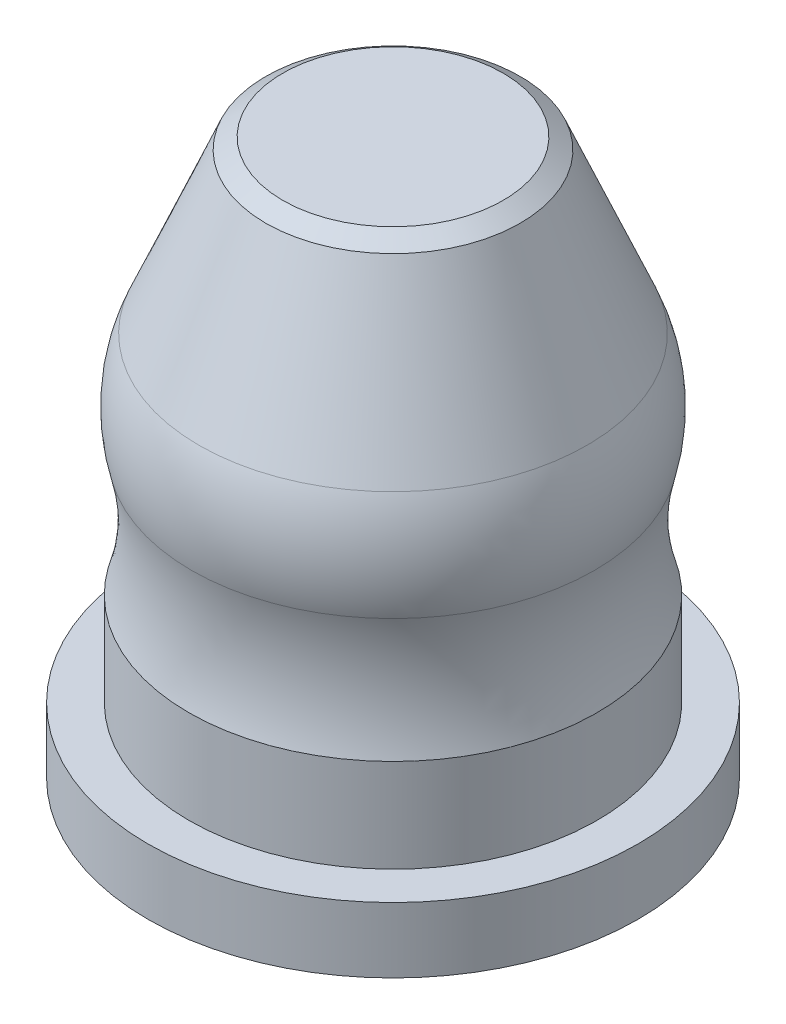
ISO-10303-21;
HEADER;
FILE_DESCRIPTION(('STEP AP214'),'2;1');
FILE_NAME('part.step','',(''),(''),'','','');
FILE_SCHEMA(('AUTOMOTIVE_DESIGN { 1 0 10303 214 1 1 1 1 }'));
ENDSEC;
DATA;
#1=APPLICATION_CONTEXT('core data for automotive mechanical design processes');
#2=APPLICATION_PROTOCOL_DEFINITION('international standard','automotive_design',2000,#1);
#3=PRODUCT_CONTEXT('',#1,'mechanical');
#4=PRODUCT('Part','Part','',(#3));
#5=PRODUCT_RELATED_PRODUCT_CATEGORY('part','',(#4));
#6=PRODUCT_DEFINITION_FORMATION('','',#4);
#7=PRODUCT_DEFINITION_CONTEXT('part definition',#1,'design');
#8=PRODUCT_DEFINITION('design','',#6,#7);
#9=PRODUCT_DEFINITION_SHAPE('','',#8);
#10=(LENGTH_UNIT() NAMED_UNIT(*) SI_UNIT(.MILLI.,.METRE.));
#11=(NAMED_UNIT(*) PLANE_ANGLE_UNIT() SI_UNIT($,.RADIAN.));
#12=(NAMED_UNIT(*) SI_UNIT($,.STERADIAN.) SOLID_ANGLE_UNIT());
#13=UNCERTAINTY_MEASURE_WITH_UNIT(LENGTH_MEASURE(1.E-05),#10,'distance_accuracy_value','');
#14=(GEOMETRIC_REPRESENTATION_CONTEXT(3) GLOBAL_UNCERTAINTY_ASSIGNED_CONTEXT((#13)) GLOBAL_UNIT_ASSIGNED_CONTEXT((#10,
#11,#12)) REPRESENTATION_CONTEXT('',''));
#15=CARTESIAN_POINT('',(0.,0.,0.));
#16=DIRECTION('',(0.,0.,1.));
#17=DIRECTION('',(1.,0.,0.));
#18=AXIS2_PLACEMENT_3D('',#15,#16,#17);
#19=CARTESIAN_POINT('',(0.,60.,0.));
#20=DIRECTION('',(0.,-1.,0.));
#21=DIRECTION('',(0.,0.,-1.));
#22=AXIS2_PLACEMENT_3D('',#19,#20,#21);
#23=PLANE('',#22);
#24=CARTESIAN_POINT('',(0.,60.,0.));
#25=DIRECTION('',(0.,1.,0.));
#26=DIRECTION('',(0.,0.,1.));
#27=AXIS2_PLACEMENT_3D('',#24,#25,#26);
#28=CIRCLE('',#27,13.5);
#29=CARTESIAN_POINT('',(0.,60.,13.5));
#30=VERTEX_POINT('',#29);
#31=EDGE_CURVE('E12',#30,#30,#28,.T.);
#32=ORIENTED_EDGE('',*,*,#31,.T.);
#33=EDGE_LOOP('',(#32));
#34=FACE_BOUND('',#33,.T.);
#35=ADVANCED_FACE('F57',(#34),#23,.F.);
#36=CARTESIAN_POINT('',(0.,58.6171943574913,0.));
#37=DIRECTION('',(0.,-1.,0.));
#38=DIRECTION('',(0.,0.,-1.));
#39=AXIS2_PLACEMENT_3D('',#36,#37,#38);
#40=CONICAL_SURFACE('',#39,15.5812474129372,0.984356308937094);
#41=ORIENTED_EDGE('',*,*,#31,.F.);
#42=EDGE_LOOP('',(#41));
#43=FACE_BOUND('',#42,.T.);
#44=CARTESIAN_POINT('',(0.,58.6171943574913,0.));
#45=DIRECTION('',(0.,1.,0.));
#46=DIRECTION('',(0.,0.,1.));
#47=AXIS2_PLACEMENT_3D('',#44,#45,#46);
#48=CIRCLE('',#47,15.5812474129372);
#49=CARTESIAN_POINT('',(0.,58.6171943574913,15.5812474129372));
#50=VERTEX_POINT('',#49);
#51=EDGE_CURVE('E64',#50,#50,#48,.T.);
#52=ORIENTED_EDGE('',*,*,#51,.T.);
#53=EDGE_LOOP('',(#52));
#54=FACE_BOUND('',#53,.T.);
#55=ADVANCED_FACE('F119',(#43,#54),#40,.T.);
#56=CARTESIAN_POINT('',(0.,39.157527644699,0.));
#57=DIRECTION('',(0.,-1.,0.));
#58=DIRECTION('',(0.,0.,-1.));
#59=AXIS2_PLACEMENT_3D('',#56,#57,#58);
#60=CONICAL_SURFACE('',#59,23.7609080866597,0.397916291079297);
#61=ORIENTED_EDGE('',*,*,#51,.F.);
#62=EDGE_LOOP('',(#61));
#63=FACE_BOUND('',#62,.T.);
#64=CARTESIAN_POINT('',(0.,39.157527644699,0.));
#65=DIRECTION('',(0.,1.,0.));
#66=DIRECTION('',(0.,0.,1.));
#67=AXIS2_PLACEMENT_3D('',#64,#65,#66);
#68=CIRCLE('',#67,23.7609080866597);
#69=CARTESIAN_POINT('',(0.,39.157527644699,23.7609080866597));
#70=VERTEX_POINT('',#69);
#71=EDGE_CURVE('E70',#70,#70,#68,.T.);
#72=ORIENTED_EDGE('',*,*,#71,.T.);
#73=EDGE_LOOP('',(#72));
#74=FACE_BOUND('',#73,.T.);
#75=ADVANCED_FACE('F123',(#63,#74),#60,.T.);
#76=CARTESIAN_POINT('',(0.,31.4075621388702,0.));
#77=DIRECTION('',(0.,1.,0.));
#78=DIRECTION('',(0.,0.,1.));
#79=AXIS2_PLACEMENT_3D('',#76,#77,#78);
#80=DEGENERATE_TOROIDAL_SURFACE('',#79,5.32349951987728,20.,.T.);
#81=ORIENTED_EDGE('',*,*,#71,.F.);
#82=EDGE_LOOP('',(#81));
#83=FACE_BOUND('',#82,.T.);
#84=CARTESIAN_POINT('',(0.,26.3456552889985,0.));
#85=DIRECTION('',(0.,1.,0.));
#86=DIRECTION('',(0.,0.,1.));
#87=AXIS2_PLACEMENT_3D('',#84,#85,#86);
#88=CIRCLE('',#87,24.6723263329743);
#89=CARTESIAN_POINT('',(0.,26.3456552889985,24.6723263329743));
#90=VERTEX_POINT('',#89);
#91=EDGE_CURVE('E76',#90,#90,#88,.T.);
#92=ORIENTED_EDGE('',*,*,#91,.T.);
#93=EDGE_LOOP('',(#92));
#94=FACE_BOUND('',#93,.T.);
#95=ADVANCED_FACE('F128',(#83,#94),#80,.T.);
#96=CARTESIAN_POINT('',(0.,19.4591558509279,0.));
#97=DIRECTION('',(0.,1.,0.));
#98=DIRECTION('',(0.,0.,1.));
#99=AXIS2_PLACEMENT_3D('',#96,#97,#98);
#100=TOROIDAL_SURFACE('',#99,50.9955458088713,27.2091116739741);
#101=ORIENTED_EDGE('',*,*,#91,.F.);
#102=EDGE_LOOP('',(#101));
#103=FACE_BOUND('',#102,.T.);
#104=CARTESIAN_POINT('',(0.,11.4237743300751,0.));
#105=DIRECTION('',(0.,1.,0.));
#106=DIRECTION('',(0.,0.,1.));
#107=AXIS2_PLACEMENT_3D('',#104,#105,#106);
#108=CIRCLE('',#107,25.);
#109=CARTESIAN_POINT('',(0.,11.4237743300751,25.));
#110=VERTEX_POINT('',#109);
#111=EDGE_CURVE('E82',#110,#110,#108,.T.);
#112=ORIENTED_EDGE('',*,*,#111,.T.);
#113=EDGE_LOOP('',(#112));
#114=FACE_BOUND('',#113,.T.);
#115=ADVANCED_FACE('F134',(#103,#114),#100,.F.);
#116=CARTESIAN_POINT('',(0.,0.,0.));
#117=DIRECTION('',(0.,1.,0.));
#118=DIRECTION('',(0.,0.,1.));
#119=AXIS2_PLACEMENT_3D('',#116,#117,#118);
#120=CYLINDRICAL_SURFACE('',#119,25.);
#121=ORIENTED_EDGE('',*,*,#111,.F.);
#122=EDGE_LOOP('',(#121));
#123=FACE_BOUND('',#122,.T.);
#124=CARTESIAN_POINT('',(0.,0.,0.));
#125=DIRECTION('',(0.,1.,0.));
#126=DIRECTION('',(0.,0.,1.));
#127=AXIS2_PLACEMENT_3D('',#124,#125,#126);
#128=CIRCLE('',#127,25.);
#129=CARTESIAN_POINT('',(0.,0.,25.));
#130=VERTEX_POINT('',#129);
#131=EDGE_CURVE('E86',#130,#130,#128,.T.);
#132=ORIENTED_EDGE('',*,*,#131,.T.);
#133=EDGE_LOOP('',(#132));
#134=FACE_BOUND('',#133,.T.);
#135=ADVANCED_FACE('F105',(#123,#134),#120,.T.);
#136=CARTESIAN_POINT('',(0.,-8.,0.));
#137=DIRECTION('',(0.,1.,0.));
#138=DIRECTION('',(0.,0.,1.));
#139=AXIS2_PLACEMENT_3D('',#136,#137,#138);
#140=CYLINDRICAL_SURFACE('',#139,30.);
#141=CARTESIAN_POINT('',(0.,-8.,0.));
#142=DIRECTION('',(0.,-1.,0.));
#143=DIRECTION('',(0.,0.,-1.));
#144=AXIS2_PLACEMENT_3D('',#141,#142,#143);
#145=CIRCLE('',#144,30.);
#146=CARTESIAN_POINT('',(0.,-8.,-30.));
#147=VERTEX_POINT('',#146);
#148=EDGE_CURVE('E90',#147,#147,#145,.T.);
#149=ORIENTED_EDGE('',*,*,#148,.F.);
#150=EDGE_LOOP('',(#149));
#151=FACE_BOUND('',#150,.T.);
#152=CARTESIAN_POINT('',(0.,0.,0.));
#153=DIRECTION('',(0.,-1.,0.));
#154=DIRECTION('',(0.,0.,-1.));
#155=AXIS2_PLACEMENT_3D('',#152,#153,#154);
#156=CIRCLE('',#155,30.);
#157=CARTESIAN_POINT('',(0.,0.,-30.));
#158=VERTEX_POINT('',#157);
#159=EDGE_CURVE('E91',#158,#158,#156,.T.);
#160=ORIENTED_EDGE('',*,*,#159,.T.);
#161=EDGE_LOOP('',(#160));
#162=FACE_BOUND('',#161,.T.);
#163=ADVANCED_FACE('F102',(#151,#162),#140,.T.);
#164=CARTESIAN_POINT('',(0.,-8.,0.));
#165=DIRECTION('',(0.,-1.,0.));
#166=DIRECTION('',(0.,0.,-1.));
#167=AXIS2_PLACEMENT_3D('',#164,#165,#166);
#168=PLANE('',#167);
#169=ORIENTED_EDGE('',*,*,#148,.T.);
#170=EDGE_LOOP('',(#169));
#171=FACE_BOUND('',#170,.T.);
#172=ADVANCED_FACE('F100',(#171),#168,.T.);
#173=CARTESIAN_POINT('',(0.,0.,0.));
#174=DIRECTION('',(0.,-1.,0.));
#175=DIRECTION('',(0.,0.,-1.));
#176=AXIS2_PLACEMENT_3D('',#173,#174,#175);
#177=PLANE('',#176);
#178=ORIENTED_EDGE('',*,*,#131,.F.);
#179=EDGE_LOOP('',(#178));
#180=FACE_BOUND('',#179,.T.);
#181=ORIENTED_EDGE('',*,*,#159,.F.);
#182=EDGE_LOOP('',(#181));
#183=FACE_BOUND('',#182,.T.);
#184=ADVANCED_FACE('F109',(#180,#183),#177,.F.);
#185=CLOSED_SHELL('',(#35,#55,#75,#95,#115,#135,#163,#172,#184));
#186=MANIFOLD_SOLID_BREP('B2',#185);
#187=ADVANCED_BREP_SHAPE_REPRESENTATION('',(#18,#186),#14);
#188=SHAPE_DEFINITION_REPRESENTATION(#9,#187);
ENDSEC;
END-ISO-10303-21;
